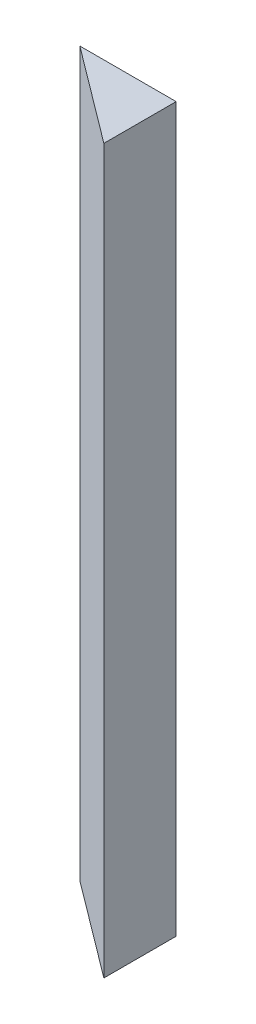
ISO-10303-21;
HEADER;
FILE_DESCRIPTION(('STEP AP214'),'2;1');
FILE_NAME('part.step','',(''),(''),'','','');
FILE_SCHEMA(('AUTOMOTIVE_DESIGN { 1 0 10303 214 1 1 1 1 }'));
ENDSEC;
DATA;
#1=APPLICATION_CONTEXT('core data for automotive mechanical design processes');
#2=APPLICATION_PROTOCOL_DEFINITION('international standard','automotive_design',2000,#1);
#3=PRODUCT_CONTEXT('',#1,'mechanical');
#4=PRODUCT('Part','Part','',(#3));
#5=PRODUCT_RELATED_PRODUCT_CATEGORY('part','',(#4));
#6=PRODUCT_DEFINITION_FORMATION('','',#4);
#7=PRODUCT_DEFINITION_CONTEXT('part definition',#1,'design');
#8=PRODUCT_DEFINITION('design','',#6,#7);
#9=PRODUCT_DEFINITION_SHAPE('','',#8);
#10=(LENGTH_UNIT() NAMED_UNIT(*) SI_UNIT(.MILLI.,.METRE.));
#11=(NAMED_UNIT(*) PLANE_ANGLE_UNIT() SI_UNIT($,.RADIAN.));
#12=(NAMED_UNIT(*) SI_UNIT($,.STERADIAN.) SOLID_ANGLE_UNIT());
#13=UNCERTAINTY_MEASURE_WITH_UNIT(LENGTH_MEASURE(1.E-05),#10,'distance_accuracy_value','');
#14=(GEOMETRIC_REPRESENTATION_CONTEXT(3) GLOBAL_UNCERTAINTY_ASSIGNED_CONTEXT((#13)) GLOBAL_UNIT_ASSIGNED_CONTEXT((#10,
#11,#12)) REPRESENTATION_CONTEXT('',''));
#15=CARTESIAN_POINT('',(0.,0.,0.));
#16=DIRECTION('',(0.,0.,1.));
#17=DIRECTION('',(1.,0.,0.));
#18=AXIS2_PLACEMENT_3D('',#15,#16,#17);
#19=CARTESIAN_POINT('',(3.906661108732,1.74999970334389,-2.35778247673823));
#20=DIRECTION('',(0.,1.,8.74227765734759E-08));
#21=DIRECTION('',(-1.,0.,0.));
#22=AXIS2_PLACEMENT_3D('',#19,#20,#21);
#23=PLANE('',#22);
#24=DIRECTION('',(0.799759704949037,-5.24816634128168E-08,0.600320259811233));
#25=VECTOR('',#24,1.);
#26=CARTESIAN_POINT('',(3.766777825356,1.74999970276156,-2.35112136800623));
#27=LINE('',#26,#25);
#28=CARTESIAN_POINT('',(3.766777825356,1.74999970276056,-2.35112136800623));
#29=VERTEX_POINT('',#28);
#30=CARTESIAN_POINT('',(3.9,1.74999969401828,-2.25112136800623));
#31=VERTEX_POINT('',#30);
#32=EDGE_CURVE('E11',#29,#31,#27,.T.);
#33=ORIENTED_EDGE('',*,*,#32,.T.);
#34=DIRECTION('',(0.,8.7422775685297E-08,-0.999999999999996));
#35=VECTOR('',#34,1.);
#36=CARTESIAN_POINT('',(3.9,1.74999969401928,-2.25112136800623));
#37=LINE('',#36,#35);
#38=CARTESIAN_POINT('',(3.9,1.74999970276056,-2.35112136800623));
#39=VERTEX_POINT('',#38);
#40=EDGE_CURVE('E49',#31,#39,#37,.T.);
#41=ORIENTED_EDGE('',*,*,#40,.T.);
#42=DIRECTION('',(-1.,0.,0.));
#43=VECTOR('',#42,1.);
#44=CARTESIAN_POINT('',(3.9,1.74999970276156,-2.35112136800623));
#45=LINE('',#44,#43);
#46=EDGE_CURVE('E47',#39,#29,#45,.T.);
#47=ORIENTED_EDGE('',*,*,#46,.T.);
#48=EDGE_LOOP('',(#33,#41,#47));
#49=FACE_BOUND('',#48,.T.);
#50=ADVANCED_FACE('F17',(#49),#23,.T.);
#51=CARTESIAN_POINT('',(3.906661108732,0.749999703343892,-2.35778256416101));
#52=DIRECTION('',(0.,1.,8.74227765734759E-08));
#53=DIRECTION('',(-1.,0.,0.));
#54=AXIS2_PLACEMENT_3D('',#51,#52,#53);
#55=PLANE('',#54);
#56=DIRECTION('',(-1.,0.,0.));
#57=VECTOR('',#56,1.);
#58=CARTESIAN_POINT('',(3.9,0.749999702761559,-2.35112145542901));
#59=LINE('',#58,#57);
#60=CARTESIAN_POINT('',(3.9,0.74999970276256,-2.35112145542901));
#61=VERTEX_POINT('',#60);
#62=CARTESIAN_POINT('',(3.766777825356,0.74999970276256,-2.35112145542901));
#63=VERTEX_POINT('',#62);
#64=EDGE_CURVE('E24',#61,#63,#59,.T.);
#65=ORIENTED_EDGE('',*,*,#64,.F.);
#66=DIRECTION('',(0.,8.74227756852974E-08,-0.999999999999996));
#67=VECTOR('',#66,1.);
#68=CARTESIAN_POINT('',(3.9,0.749999694019282,-2.25112145542901));
#69=LINE('',#68,#67);
#70=CARTESIAN_POINT('',(3.9,0.749999694020282,-2.25112145542901));
#71=VERTEX_POINT('',#70);
#72=EDGE_CURVE('E53',#71,#61,#69,.T.);
#73=ORIENTED_EDGE('',*,*,#72,.F.);
#74=DIRECTION('',(0.799759704949036,-5.24816634128169E-08,0.600320259811234));
#75=VECTOR('',#74,1.);
#76=CARTESIAN_POINT('',(3.766777825356,0.749999702761559,-2.35112145542901));
#77=LINE('',#76,#75);
#78=EDGE_CURVE('E68',#63,#71,#77,.T.);
#79=ORIENTED_EDGE('',*,*,#78,.F.);
#80=EDGE_LOOP('',(#65,#73,#79));
#81=FACE_BOUND('',#80,.T.);
#82=ADVANCED_FACE('F73',(#81),#55,.F.);
#83=CARTESIAN_POINT('',(3.766777825356,1.74999970276156,-2.35112136800623));
#84=DIRECTION('',(0.600320259811235,6.99172139982287E-08,-0.799759704949038));
#85=DIRECTION('',(0.799759704949038,-5.24816639460086E-08,0.600320259811235));
#86=AXIS2_PLACEMENT_3D('',#83,#84,#85);
#87=PLANE('',#86);
#88=DIRECTION('',(0.,-0.999999999999996,-8.74227765734755E-08));
#89=VECTOR('',#88,1.);
#90=CARTESIAN_POINT('',(3.766777825356,1.74999970276156,-2.35112136800623));
#91=LINE('',#90,#89);
#92=EDGE_CURVE('E59',#29,#63,#91,.T.);
#93=ORIENTED_EDGE('',*,*,#92,.T.);
#94=ORIENTED_EDGE('',*,*,#78,.T.);
#95=DIRECTION('',(0.,-0.999999999999996,-8.74227765734755E-08));
#96=VECTOR('',#95,1.);
#97=CARTESIAN_POINT('',(3.9,1.74999969401928,-2.25112136800623));
#98=LINE('',#97,#96);
#99=EDGE_CURVE('E54',#31,#71,#98,.T.);
#100=ORIENTED_EDGE('',*,*,#99,.F.);
#101=ORIENTED_EDGE('',*,*,#32,.F.);
#102=EDGE_LOOP('',(#93,#94,#100,#101));
#103=FACE_BOUND('',#102,.T.);
#104=ADVANCED_FACE('F57',(#103),#87,.F.);
#105=CARTESIAN_POINT('',(3.9,1.74999969401928,-2.25112136800623));
#106=DIRECTION('',(-1.,0.,0.));
#107=DIRECTION('',(0.,8.74227765734759E-08,-1.));
#108=AXIS2_PLACEMENT_3D('',#105,#106,#107);
#109=PLANE('',#108);
#110=ORIENTED_EDGE('',*,*,#99,.T.);
#111=ORIENTED_EDGE('',*,*,#72,.T.);
#112=DIRECTION('',(0.,-0.999999999999996,-8.74227765734755E-08));
#113=VECTOR('',#112,1.);
#114=CARTESIAN_POINT('',(3.9,1.74999970276156,-2.35112136800623));
#115=LINE('',#114,#113);
#116=EDGE_CURVE('E70',#39,#61,#115,.T.);
#117=ORIENTED_EDGE('',*,*,#116,.F.);
#118=ORIENTED_EDGE('',*,*,#40,.F.);
#119=EDGE_LOOP('',(#110,#111,#117,#118));
#120=FACE_BOUND('',#119,.T.);
#121=ADVANCED_FACE('F72',(#120),#109,.F.);
#122=CARTESIAN_POINT('',(3.9,1.74999970276156,-2.35112136800623));
#123=DIRECTION('',(0.,-8.74227765734759E-08,1.));
#124=DIRECTION('',(-1.,0.,0.));
#125=AXIS2_PLACEMENT_3D('',#122,#123,#124);
#126=PLANE('',#125);
#127=ORIENTED_EDGE('',*,*,#116,.T.);
#128=ORIENTED_EDGE('',*,*,#64,.T.);
#129=ORIENTED_EDGE('',*,*,#92,.F.);
#130=ORIENTED_EDGE('',*,*,#46,.F.);
#131=EDGE_LOOP('',(#127,#128,#129,#130));
#132=FACE_BOUND('',#131,.T.);
#133=ADVANCED_FACE('F61',(#132),#126,.F.);
#134=CLOSED_SHELL('',(#50,#82,#104,#121,#133));
#135=MANIFOLD_SOLID_BREP('B1',#134);
#136=ADVANCED_BREP_SHAPE_REPRESENTATION('',(#18,#135),#14);
#137=SHAPE_DEFINITION_REPRESENTATION(#9,#136);
ENDSEC;
END-ISO-10303-21;
